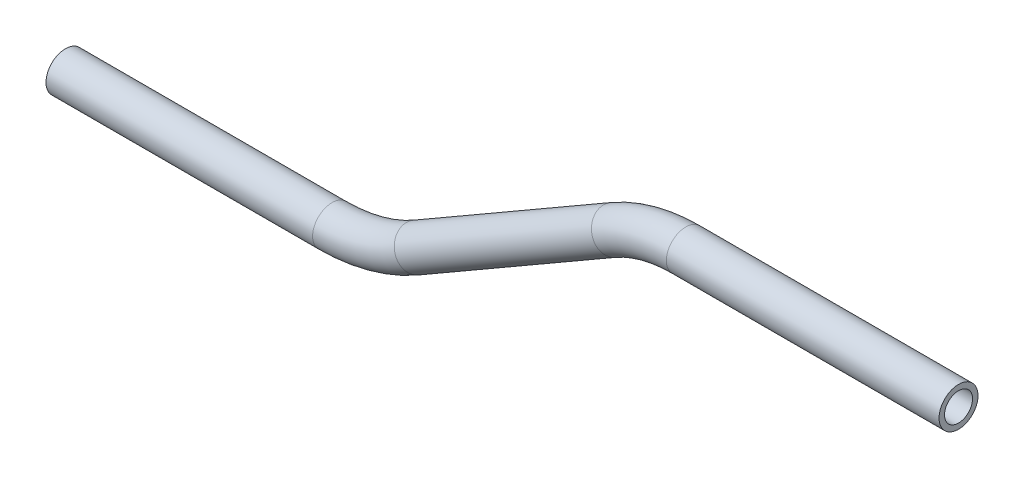
ISO-10303-21;
HEADER;
FILE_DESCRIPTION(('STEP AP214'),'2;1');
FILE_NAME('part.step','',(''),(''),'','','');
FILE_SCHEMA(('AUTOMOTIVE_DESIGN { 1 0 10303 214 1 1 1 1 }'));
ENDSEC;
DATA;
#1=APPLICATION_CONTEXT('core data for automotive mechanical design processes');
#2=APPLICATION_PROTOCOL_DEFINITION('international standard','automotive_design',2000,#1);
#3=PRODUCT_CONTEXT('',#1,'mechanical');
#4=PRODUCT('Part','Part','',(#3));
#5=PRODUCT_RELATED_PRODUCT_CATEGORY('part','',(#4));
#6=PRODUCT_DEFINITION_FORMATION('','',#4);
#7=PRODUCT_DEFINITION_CONTEXT('part definition',#1,'design');
#8=PRODUCT_DEFINITION('design','',#6,#7);
#9=PRODUCT_DEFINITION_SHAPE('','',#8);
#10=(LENGTH_UNIT() NAMED_UNIT(*) SI_UNIT(.MILLI.,.METRE.));
#11=(NAMED_UNIT(*) PLANE_ANGLE_UNIT() SI_UNIT($,.RADIAN.));
#12=(NAMED_UNIT(*) SI_UNIT($,.STERADIAN.) SOLID_ANGLE_UNIT());
#13=UNCERTAINTY_MEASURE_WITH_UNIT(LENGTH_MEASURE(1.E-05),#10,'distance_accuracy_value','');
#14=(GEOMETRIC_REPRESENTATION_CONTEXT(3) GLOBAL_UNCERTAINTY_ASSIGNED_CONTEXT((#13)) GLOBAL_UNIT_ASSIGNED_CONTEXT((#10,
#11,#12)) REPRESENTATION_CONTEXT('',''));
#15=CARTESIAN_POINT('',(0.,0.,0.));
#16=DIRECTION('',(0.,0.,1.));
#17=DIRECTION('',(1.,0.,0.));
#18=AXIS2_PLACEMENT_3D('',#15,#16,#17);
#19=CARTESIAN_POINT('',(-101.134087778049,-25.4000000000006,0.));
#20=DIRECTION('',(1.,0.,0.));
#21=DIRECTION('',(0.,1.,0.));
#22=AXIS2_PLACEMENT_3D('',#19,#20,#21);
#23=CYLINDRICAL_SURFACE('',#22,3.175);
#24=CARTESIAN_POINT('',(-57.672010970273,-25.4000000000003,0.));
#25=DIRECTION('',(1.,0.,0.));
#26=DIRECTION('',(0.,1.,0.));
#27=AXIS2_PLACEMENT_3D('',#24,#25,#26);
#28=CIRCLE('',#27,3.175);
#29=CARTESIAN_POINT('',(-57.672010970273,-28.5749999999998,0.));
#30=VERTEX_POINT('',#29);
#31=EDGE_CURVE('E65',#30,#30,#28,.T.);
#32=ORIENTED_EDGE('',*,*,#31,.F.);
#33=EDGE_LOOP('',(#32));
#34=FACE_BOUND('',#33,.T.);
#35=CARTESIAN_POINT('',(-101.134087778049,-25.4000000000006,0.));
#36=DIRECTION('',(1.,0.,0.));
#37=DIRECTION('',(0.,1.,0.));
#38=AXIS2_PLACEMENT_3D('',#35,#36,#37);
#39=CIRCLE('',#38,3.175);
#40=CARTESIAN_POINT('',(-101.134087778049,-22.2250000000006,0.));
#41=VERTEX_POINT('',#40);
#42=EDGE_CURVE('E61',#41,#41,#39,.T.);
#43=ORIENTED_EDGE('',*,*,#42,.T.);
#44=EDGE_LOOP('',(#43));
#45=FACE_BOUND('',#44,.T.);
#46=ADVANCED_FACE('F37',(#34,#45),#23,.T.);
#47=CARTESIAN_POINT('',(-57.672010970273,1.98550217542068,0.));
#48=DIRECTION('',(0.,0.,1.));
#49=DIRECTION('',(1.,0.,0.));
#50=AXIS2_PLACEMENT_3D('',#47,#48,#49);
#51=TOROIDAL_SURFACE('',#50,27.3855021754205,3.175);
#52=CARTESIAN_POINT('',(-43.9792598825628,-21.7310384038876,0.));
#53=DIRECTION('',(0.86602540378444,0.499999999999998,0.));
#54=DIRECTION('',(-0.499999999999998,0.86602540378444,0.));
#55=AXIS2_PLACEMENT_3D('',#52,#53,#54);
#56=CIRCLE('',#55,3.175);
#57=CARTESIAN_POINT('',(-42.3917598825628,-24.4806690609031,0.));
#58=VERTEX_POINT('',#57);
#59=EDGE_CURVE('E69',#58,#58,#56,.T.);
#60=CARTESIAN_POINT('',(-57.672010970273,1.98550217542068,0.));
#61=DIRECTION('',(0.,0.,1.));
#62=DIRECTION('',(1.,0.,0.));
#63=AXIS2_PLACEMENT_3D('',#60,#61,#62);
#64=CIRCLE('',#63,30.5605021754205);
#65=EDGE_CURVE('',#30,#58,#64,.T.);
#66=ORIENTED_EDGE('',*,*,#31,.T.);
#67=ORIENTED_EDGE('',*,*,#59,.F.);
#68=ORIENTED_EDGE('',*,*,#65,.T.);
#69=ORIENTED_EDGE('',*,*,#65,.F.);
#70=EDGE_LOOP('',(#66,#68,#67,#69));
#71=FACE_BOUND('',#70,.T.);
#72=ADVANCED_FACE('F91',(#71),#51,.T.);
#73=CARTESIAN_POINT('',(-43.9792598825628,-21.7310384038875,0.));
#74=DIRECTION('',(0.866025403784437,0.500000000000003,0.));
#75=DIRECTION('',(-0.500000000000003,0.866025403784437,0.));
#76=AXIS2_PLACEMENT_3D('',#73,#74,#75);
#77=CYLINDRICAL_SURFACE('',#76,3.175);
#78=CARTESIAN_POINT('',(-11.8305959579056,-3.16999863289972,0.));
#79=DIRECTION('',(0.866025403784437,0.500000000000003,0.));
#80=DIRECTION('',(-0.500000000000003,0.866025403784437,0.));
#81=AXIS2_PLACEMENT_3D('',#78,#79,#80);
#82=CIRCLE('',#81,3.175);
#83=CARTESIAN_POINT('',(-13.4180959579056,-0.420367975884135,0.));
#84=VERTEX_POINT('',#83);
#85=EDGE_CURVE('E72',#84,#84,#82,.T.);
#86=ORIENTED_EDGE('',*,*,#85,.F.);
#87=EDGE_LOOP('',(#86));
#88=FACE_BOUND('',#87,.T.);
#89=ORIENTED_EDGE('',*,*,#59,.T.);
#90=EDGE_LOOP('',(#89));
#91=FACE_BOUND('',#90,.T.);
#92=ADVANCED_FACE('F84',(#88,#91),#77,.T.);
#93=CARTESIAN_POINT('',(0.,-23.661191915811,0.));
#94=DIRECTION('',(0.,0.,-1.));
#95=DIRECTION('',(-1.,0.,0.));
#96=AXIS2_PLACEMENT_3D('',#93,#94,#95);
#97=TOROIDAL_SURFACE('',#96,23.661191915811,3.175);
#98=CARTESIAN_POINT('',(0.,0.,0.));
#99=DIRECTION('',(1.,0.,0.));
#100=DIRECTION('',(0.,1.,0.));
#101=AXIS2_PLACEMENT_3D('',#98,#99,#100);
#102=CIRCLE('',#101,3.175);
#103=CARTESIAN_POINT('',(0.,3.175,0.));
#104=VERTEX_POINT('',#103);
#105=EDGE_CURVE('E41',#104,#104,#102,.T.);
#106=CARTESIAN_POINT('',(0.,-23.661191915811,0.));
#107=DIRECTION('',(0.,0.,-1.));
#108=DIRECTION('',(-1.,0.,0.));
#109=AXIS2_PLACEMENT_3D('',#106,#107,#108);
#110=CIRCLE('',#109,26.836191915811);
#111=EDGE_CURVE('',#84,#104,#110,.T.);
#112=ORIENTED_EDGE('',*,*,#85,.T.);
#113=ORIENTED_EDGE('',*,*,#105,.F.);
#114=ORIENTED_EDGE('',*,*,#111,.T.);
#115=ORIENTED_EDGE('',*,*,#111,.F.);
#116=EDGE_LOOP('',(#112,#114,#113,#115));
#117=FACE_BOUND('',#116,.T.);
#118=ADVANCED_FACE('F82',(#117),#97,.T.);
#119=CARTESIAN_POINT('',(0.,0.,0.));
#120=DIRECTION('',(1.,0.,0.));
#121=DIRECTION('',(0.,1.,0.));
#122=AXIS2_PLACEMENT_3D('',#119,#120,#121);
#123=CYLINDRICAL_SURFACE('',#122,3.175);
#124=CARTESIAN_POINT('',(44.4600027342006,0.,0.));
#125=DIRECTION('',(1.,0.,0.));
#126=DIRECTION('',(0.,1.,0.));
#127=AXIS2_PLACEMENT_3D('',#124,#125,#126);
#128=CIRCLE('',#127,3.175);
#129=CARTESIAN_POINT('',(44.4600027342006,3.175,0.));
#130=VERTEX_POINT('',#129);
#131=EDGE_CURVE('E56',#130,#130,#128,.T.);
#132=ORIENTED_EDGE('',*,*,#131,.F.);
#133=EDGE_LOOP('',(#132));
#134=FACE_BOUND('',#133,.T.);
#135=ORIENTED_EDGE('',*,*,#105,.T.);
#136=EDGE_LOOP('',(#135));
#137=FACE_BOUND('',#136,.T.);
#138=ADVANCED_FACE('F39',(#134,#137),#123,.T.);
#139=CARTESIAN_POINT('',(-101.134087778049,-25.4000000000006,0.));
#140=DIRECTION('',(1.,0.,0.));
#141=DIRECTION('',(0.,1.,0.));
#142=AXIS2_PLACEMENT_3D('',#139,#140,#141);
#143=PLANE('',#142);
#144=CARTESIAN_POINT('',(-101.134087778049,-25.4000000000006,0.));
#145=DIRECTION('',(1.,0.,0.));
#146=DIRECTION('',(0.,1.,0.));
#147=AXIS2_PLACEMENT_3D('',#144,#145,#146);
#148=CIRCLE('',#147,2.286);
#149=CARTESIAN_POINT('',(-101.134087778049,-23.1140000000006,0.));
#150=VERTEX_POINT('',#149);
#151=EDGE_CURVE('E60',#150,#150,#148,.F.);
#152=ORIENTED_EDGE('',*,*,#151,.F.);
#153=EDGE_LOOP('',(#152));
#154=FACE_BOUND('',#153,.T.);
#155=ORIENTED_EDGE('',*,*,#42,.F.);
#156=EDGE_LOOP('',(#155));
#157=FACE_BOUND('',#156,.T.);
#158=ADVANCED_FACE('F89',(#154,#157),#143,.F.);
#159=CARTESIAN_POINT('',(44.4600027342006,0.,0.));
#160=DIRECTION('',(1.,0.,0.));
#161=DIRECTION('',(0.,1.,0.));
#162=AXIS2_PLACEMENT_3D('',#159,#160,#161);
#163=PLANE('',#162);
#164=CARTESIAN_POINT('',(44.4600027342006,0.,0.));
#165=DIRECTION('',(1.,0.,0.));
#166=DIRECTION('',(0.,1.,0.));
#167=AXIS2_PLACEMENT_3D('',#164,#165,#166);
#168=CIRCLE('',#167,2.286);
#169=CARTESIAN_POINT('',(44.4600027342006,2.286,0.));
#170=VERTEX_POINT('',#169);
#171=EDGE_CURVE('E10',#170,#170,#168,.F.);
#172=ORIENTED_EDGE('',*,*,#171,.T.);
#173=EDGE_LOOP('',(#172));
#174=FACE_BOUND('',#173,.T.);
#175=ORIENTED_EDGE('',*,*,#131,.T.);
#176=EDGE_LOOP('',(#175));
#177=FACE_BOUND('',#176,.T.);
#178=ADVANCED_FACE('F108',(#174,#177),#163,.T.);
#179=CARTESIAN_POINT('',(-101.134087778049,-25.4000000000006,0.));
#180=DIRECTION('',(1.,0.,0.));
#181=DIRECTION('',(0.,1.,0.));
#182=AXIS2_PLACEMENT_3D('',#179,#180,#181);
#183=CYLINDRICAL_SURFACE('',#182,2.286);
#184=CARTESIAN_POINT('',(-57.672010970273,-25.4000000000003,0.));
#185=DIRECTION('',(1.,0.,0.));
#186=DIRECTION('',(0.,1.,0.));
#187=AXIS2_PLACEMENT_3D('',#184,#185,#186);
#188=CIRCLE('',#187,2.286);
#189=CARTESIAN_POINT('',(-57.672010970273,-27.6859999999998,0.));
#190=VERTEX_POINT('',#189);
#191=EDGE_CURVE('E205',#190,#190,#188,.F.);
#192=ORIENTED_EDGE('',*,*,#191,.F.);
#193=EDGE_LOOP('',(#192));
#194=FACE_BOUND('',#193,.T.);
#195=ORIENTED_EDGE('',*,*,#151,.T.);
#196=EDGE_LOOP('',(#195));
#197=FACE_BOUND('',#196,.T.);
#198=ADVANCED_FACE('F111',(#194,#197),#183,.F.);
#199=CARTESIAN_POINT('',(-57.672010970273,1.98550217542068,0.));
#200=DIRECTION('',(0.,0.,1.));
#201=DIRECTION('',(1.,0.,0.));
#202=AXIS2_PLACEMENT_3D('',#199,#200,#201);
#203=TOROIDAL_SURFACE('',#202,27.3855021754205,2.286);
#204=CARTESIAN_POINT('',(-43.9792598825628,-21.7310384038876,0.));
#205=DIRECTION('',(0.86602540378444,0.499999999999998,0.));
#206=DIRECTION('',(-0.499999999999998,0.86602540378444,0.));
#207=AXIS2_PLACEMENT_3D('',#204,#205,#206);
#208=CIRCLE('',#207,2.286);
#209=CARTESIAN_POINT('',(-42.8362598825628,-23.7107724769388,0.));
#210=VERTEX_POINT('',#209);
#211=EDGE_CURVE('E203',#210,#210,#208,.F.);
#212=CARTESIAN_POINT('',(-57.672010970273,1.98550217542068,0.));
#213=DIRECTION('',(0.,0.,1.));
#214=DIRECTION('',(1.,0.,0.));
#215=AXIS2_PLACEMENT_3D('',#212,#213,#214);
#216=CIRCLE('',#215,29.6715021754205);
#217=EDGE_CURVE('',#190,#210,#216,.T.);
#218=ORIENTED_EDGE('',*,*,#191,.T.);
#219=ORIENTED_EDGE('',*,*,#211,.F.);
#220=ORIENTED_EDGE('',*,*,#217,.T.);
#221=ORIENTED_EDGE('',*,*,#217,.F.);
#222=EDGE_LOOP('',(#218,#220,#219,#221));
#223=FACE_BOUND('',#222,.T.);
#224=ADVANCED_FACE('F166',(#223),#203,.F.);
#225=CARTESIAN_POINT('',(-43.9792598825628,-21.7310384038875,0.));
#226=DIRECTION('',(0.866025403784437,0.500000000000003,0.));
#227=DIRECTION('',(-0.500000000000003,0.866025403784437,0.));
#228=AXIS2_PLACEMENT_3D('',#225,#226,#227);
#229=CYLINDRICAL_SURFACE('',#228,2.286);
#230=CARTESIAN_POINT('',(-11.8305959579056,-3.16999863289972,0.));
#231=DIRECTION('',(0.866025403784437,0.500000000000003,0.));
#232=DIRECTION('',(-0.500000000000003,0.866025403784437,0.));
#233=AXIS2_PLACEMENT_3D('',#230,#231,#232);
#234=CIRCLE('',#233,2.286);
#235=CARTESIAN_POINT('',(-12.9735959579056,-1.1902645598485,0.));
#236=VERTEX_POINT('',#235);
#237=EDGE_CURVE('E52',#236,#236,#234,.F.);
#238=ORIENTED_EDGE('',*,*,#237,.F.);
#239=EDGE_LOOP('',(#238));
#240=FACE_BOUND('',#239,.T.);
#241=ORIENTED_EDGE('',*,*,#211,.T.);
#242=EDGE_LOOP('',(#241));
#243=FACE_BOUND('',#242,.T.);
#244=ADVANCED_FACE('F102',(#240,#243),#229,.F.);
#245=CARTESIAN_POINT('',(0.,-23.661191915811,0.));
#246=DIRECTION('',(0.,0.,-1.));
#247=DIRECTION('',(-1.,0.,0.));
#248=AXIS2_PLACEMENT_3D('',#245,#246,#247);
#249=TOROIDAL_SURFACE('',#248,23.661191915811,2.286);
#250=CARTESIAN_POINT('',(0.,0.,0.));
#251=DIRECTION('',(1.,0.,0.));
#252=DIRECTION('',(0.,1.,0.));
#253=AXIS2_PLACEMENT_3D('',#250,#251,#252);
#254=CIRCLE('',#253,2.286);
#255=CARTESIAN_POINT('',(0.,2.286,0.));
#256=VERTEX_POINT('',#255);
#257=EDGE_CURVE('E46',#256,#256,#254,.F.);
#258=CARTESIAN_POINT('',(0.,-23.661191915811,0.));
#259=DIRECTION('',(0.,0.,-1.));
#260=DIRECTION('',(-1.,0.,0.));
#261=AXIS2_PLACEMENT_3D('',#258,#259,#260);
#262=CIRCLE('',#261,25.947191915811);
#263=EDGE_CURVE('',#236,#256,#262,.T.);
#264=ORIENTED_EDGE('',*,*,#237,.T.);
#265=ORIENTED_EDGE('',*,*,#257,.F.);
#266=ORIENTED_EDGE('',*,*,#263,.T.);
#267=ORIENTED_EDGE('',*,*,#263,.F.);
#268=EDGE_LOOP('',(#264,#266,#265,#267));
#269=FACE_BOUND('',#268,.T.);
#270=ADVANCED_FACE('F96',(#269),#249,.F.);
#271=CARTESIAN_POINT('',(0.,0.,0.));
#272=DIRECTION('',(1.,0.,0.));
#273=DIRECTION('',(0.,1.,0.));
#274=AXIS2_PLACEMENT_3D('',#271,#272,#273);
#275=CYLINDRICAL_SURFACE('',#274,2.286);
#276=ORIENTED_EDGE('',*,*,#171,.F.);
#277=EDGE_LOOP('',(#276));
#278=FACE_BOUND('',#277,.T.);
#279=ORIENTED_EDGE('',*,*,#257,.T.);
#280=EDGE_LOOP('',(#279));
#281=FACE_BOUND('',#280,.T.);
#282=ADVANCED_FACE('F94',(#278,#281),#275,.F.);
#283=CLOSED_SHELL('',(#46,#72,#92,#118,#138,#158,#178,#198,#224,#244,#270,#282));
#284=MANIFOLD_SOLID_BREP('B2',#283);
#285=ADVANCED_BREP_SHAPE_REPRESENTATION('',(#18,#284),#14);
#286=SHAPE_DEFINITION_REPRESENTATION(#9,#285);
ENDSEC;
END-ISO-10303-21;
